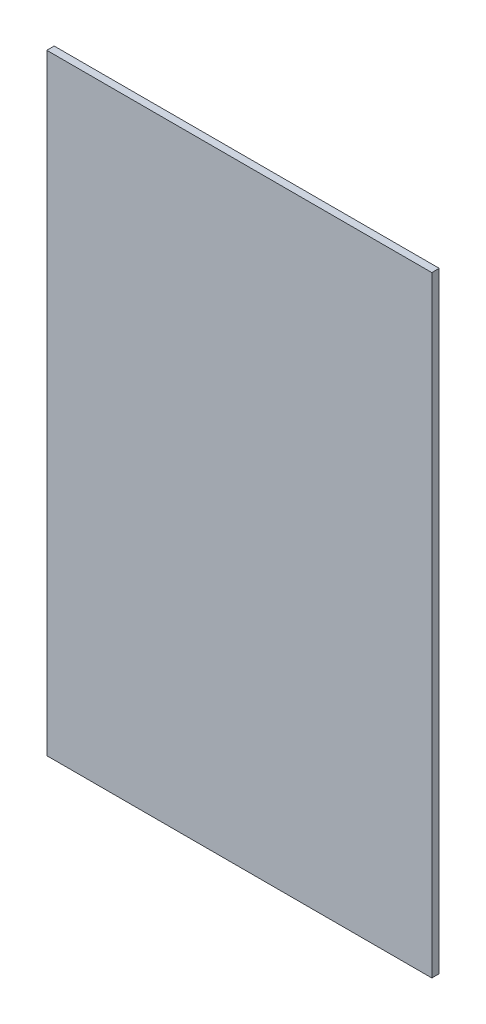
ISO-10303-21;
HEADER;
FILE_DESCRIPTION(('STEP AP214'),'2;1');
FILE_NAME('part.step','',(''),(''),'','','');
FILE_SCHEMA(('AUTOMOTIVE_DESIGN { 1 0 10303 214 1 1 1 1 }'));
ENDSEC;
DATA;
#1=APPLICATION_CONTEXT('core data for automotive mechanical design processes');
#2=APPLICATION_PROTOCOL_DEFINITION('international standard','automotive_design',2000,#1);
#3=PRODUCT_CONTEXT('',#1,'mechanical');
#4=PRODUCT('Part','Part','',(#3));
#5=PRODUCT_RELATED_PRODUCT_CATEGORY('part','',(#4));
#6=PRODUCT_DEFINITION_FORMATION('','',#4);
#7=PRODUCT_DEFINITION_CONTEXT('part definition',#1,'design');
#8=PRODUCT_DEFINITION('design','',#6,#7);
#9=PRODUCT_DEFINITION_SHAPE('','',#8);
#10=(LENGTH_UNIT() NAMED_UNIT(*) SI_UNIT(.MILLI.,.METRE.));
#11=(NAMED_UNIT(*) PLANE_ANGLE_UNIT() SI_UNIT($,.RADIAN.));
#12=(NAMED_UNIT(*) SI_UNIT($,.STERADIAN.) SOLID_ANGLE_UNIT());
#13=UNCERTAINTY_MEASURE_WITH_UNIT(LENGTH_MEASURE(1.E-05),#10,'distance_accuracy_value','');
#14=(GEOMETRIC_REPRESENTATION_CONTEXT(3) GLOBAL_UNCERTAINTY_ASSIGNED_CONTEXT((#13)) GLOBAL_UNIT_ASSIGNED_CONTEXT((#10,
#11,#12)) REPRESENTATION_CONTEXT('',''));
#15=CARTESIAN_POINT('',(0.,0.,0.));
#16=DIRECTION('',(0.,0.,1.));
#17=DIRECTION('',(1.,0.,0.));
#18=AXIS2_PLACEMENT_3D('',#15,#16,#17);
#19=CARTESIAN_POINT('',(-660.4,835.025,82.55));
#20=DIRECTION('',(1.,0.,0.));
#21=DIRECTION('',(0.,1.,0.));
#22=AXIS2_PLACEMENT_3D('',#19,#20,#21);
#23=PLANE('',#22);
#24=DIRECTION('',(0.,1.,0.));
#25=VECTOR('',#24,1.);
#26=CARTESIAN_POINT('',(-660.4,660.4,88.9));
#27=LINE('',#26,#25);
#28=CARTESIAN_POINT('',(-660.4,323.85,88.9));
#29=VERTEX_POINT('',#28);
#30=CARTESIAN_POINT('',(-660.4,1371.6,88.9));
#31=VERTEX_POINT('',#30);
#32=EDGE_CURVE('E82',#29,#31,#27,.T.);
#33=ORIENTED_EDGE('',*,*,#32,.F.);
#34=DIRECTION('',(0.,0.,-1.));
#35=VECTOR('',#34,1.);
#36=CARTESIAN_POINT('',(-660.4,323.85,88.902));
#37=LINE('',#36,#35);
#38=CARTESIAN_POINT('',(-660.4,323.85,76.2));
#39=VERTEX_POINT('',#38);
#40=EDGE_CURVE('E86',#29,#39,#37,.T.);
#41=ORIENTED_EDGE('',*,*,#40,.T.);
#42=DIRECTION('',(0.,1.,0.));
#43=VECTOR('',#42,1.);
#44=CARTESIAN_POINT('',(-660.4,847.725,76.2));
#45=LINE('',#44,#43);
#46=CARTESIAN_POINT('',(-660.4,1371.6,76.2));
#47=VERTEX_POINT('',#46);
#48=EDGE_CURVE('E91',#39,#47,#45,.T.);
#49=ORIENTED_EDGE('',*,*,#48,.T.);
#50=DIRECTION('',(0.,0.,1.));
#51=VECTOR('',#50,1.);
#52=CARTESIAN_POINT('',(-660.4,1371.6,88.902));
#53=LINE('',#52,#51);
#54=EDGE_CURVE('E75',#47,#31,#53,.T.);
#55=ORIENTED_EDGE('',*,*,#54,.T.);
#56=EDGE_LOOP('',(#33,#41,#49,#55));
#57=FACE_BOUND('',#56,.T.);
#58=ADVANCED_FACE('F16',(#57),#23,.T.);
#59=CARTESIAN_POINT('',(-1320.8,847.725,88.902));
#60=DIRECTION('',(1.,0.,0.));
#61=DIRECTION('',(0.,1.,0.));
#62=AXIS2_PLACEMENT_3D('',#59,#60,#61);
#63=PLANE('',#62);
#64=DIRECTION('',(0.,-1.,0.));
#65=VECTOR('',#64,1.);
#66=CARTESIAN_POINT('',(-1320.8,847.725,88.9));
#67=LINE('',#66,#65);
#68=CARTESIAN_POINT('',(-1320.8,1371.6,88.9));
#69=VERTEX_POINT('',#68);
#70=CARTESIAN_POINT('',(-1320.8,323.85,88.9));
#71=VERTEX_POINT('',#70);
#72=EDGE_CURVE('E11',#69,#71,#67,.T.);
#73=ORIENTED_EDGE('',*,*,#72,.F.);
#74=DIRECTION('',(0.,0.,-1.));
#75=VECTOR('',#74,1.);
#76=CARTESIAN_POINT('',(-1320.8,1371.6,88.902));
#77=LINE('',#76,#75);
#78=CARTESIAN_POINT('',(-1320.8,1371.6,76.2));
#79=VERTEX_POINT('',#78);
#80=EDGE_CURVE('E104',#69,#79,#77,.T.);
#81=ORIENTED_EDGE('',*,*,#80,.T.);
#82=DIRECTION('',(0.,-1.,0.));
#83=VECTOR('',#82,1.);
#84=CARTESIAN_POINT('',(-1320.8,847.725,76.2));
#85=LINE('',#84,#83);
#86=CARTESIAN_POINT('',(-1320.8,323.85,76.2));
#87=VERTEX_POINT('',#86);
#88=EDGE_CURVE('E101',#79,#87,#85,.T.);
#89=ORIENTED_EDGE('',*,*,#88,.T.);
#90=DIRECTION('',(0.,0.,-1.));
#91=VECTOR('',#90,1.);
#92=CARTESIAN_POINT('',(-1320.8,323.85,88.902));
#93=LINE('',#92,#91);
#94=EDGE_CURVE('E55',#71,#87,#93,.T.);
#95=ORIENTED_EDGE('',*,*,#94,.F.);
#96=EDGE_LOOP('',(#73,#81,#89,#95));
#97=FACE_BOUND('',#96,.T.);
#98=ADVANCED_FACE('F119',(#97),#63,.F.);
#99=CARTESIAN_POINT('',(-660.4,323.85,88.902));
#100=DIRECTION('',(0.,1.,0.));
#101=DIRECTION('',(0.,0.,1.));
#102=AXIS2_PLACEMENT_3D('',#99,#100,#101);
#103=PLANE('',#102);
#104=ORIENTED_EDGE('',*,*,#40,.F.);
#105=DIRECTION('',(1.,0.,0.));
#106=VECTOR('',#105,1.);
#107=CARTESIAN_POINT('',(-660.4,323.85,88.9));
#108=LINE('',#107,#106);
#109=EDGE_CURVE('E19',#71,#29,#108,.T.);
#110=ORIENTED_EDGE('',*,*,#109,.F.);
#111=ORIENTED_EDGE('',*,*,#94,.T.);
#112=DIRECTION('',(1.,0.,0.));
#113=VECTOR('',#112,1.);
#114=CARTESIAN_POINT('',(-660.4,323.85,76.2));
#115=LINE('',#114,#113);
#116=EDGE_CURVE('E65',#87,#39,#115,.T.);
#117=ORIENTED_EDGE('',*,*,#116,.T.);
#118=EDGE_LOOP('',(#104,#110,#111,#117));
#119=FACE_BOUND('',#118,.T.);
#120=ADVANCED_FACE('F87',(#119),#103,.F.);
#121=CARTESIAN_POINT('',(-660.4,847.725,76.2));
#122=DIRECTION('',(0.,0.,1.));
#123=DIRECTION('',(1.,0.,0.));
#124=AXIS2_PLACEMENT_3D('',#121,#122,#123);
#125=PLANE('',#124);
#126=ORIENTED_EDGE('',*,*,#48,.F.);
#127=ORIENTED_EDGE('',*,*,#116,.F.);
#128=ORIENTED_EDGE('',*,*,#88,.F.);
#129=DIRECTION('',(-1.,0.,0.));
#130=VECTOR('',#129,1.);
#131=CARTESIAN_POINT('',(-796.925,1371.6,76.2));
#132=LINE('',#131,#130);
#133=EDGE_CURVE('E84',#47,#79,#132,.T.);
#134=ORIENTED_EDGE('',*,*,#133,.F.);
#135=EDGE_LOOP('',(#126,#127,#128,#134));
#136=FACE_BOUND('',#135,.T.);
#137=ADVANCED_FACE('F121',(#136),#125,.F.);
#138=CARTESIAN_POINT('',(-796.925,1371.6,88.902));
#139=DIRECTION('',(0.,-1.,0.));
#140=DIRECTION('',(0.,0.,-1.));
#141=AXIS2_PLACEMENT_3D('',#138,#139,#140);
#142=PLANE('',#141);
#143=ORIENTED_EDGE('',*,*,#54,.F.);
#144=ORIENTED_EDGE('',*,*,#133,.T.);
#145=ORIENTED_EDGE('',*,*,#80,.F.);
#146=DIRECTION('',(-1.,0.,0.));
#147=VECTOR('',#146,1.);
#148=CARTESIAN_POINT('',(-796.925,1371.6,88.9));
#149=LINE('',#148,#147);
#150=EDGE_CURVE('E26',#31,#69,#149,.T.);
#151=ORIENTED_EDGE('',*,*,#150,.F.);
#152=EDGE_LOOP('',(#143,#144,#145,#151));
#153=FACE_BOUND('',#152,.T.);
#154=ADVANCED_FACE('F122',(#153),#142,.F.);
#155=CARTESIAN_POINT('',(2.22044604925032E-13,660.4,88.9));
#156=DIRECTION('',(0.,0.,1.));
#157=DIRECTION('',(1.,0.,0.));
#158=AXIS2_PLACEMENT_3D('',#155,#156,#157);
#159=PLANE('',#158);
#160=ORIENTED_EDGE('',*,*,#109,.T.);
#161=ORIENTED_EDGE('',*,*,#32,.T.);
#162=ORIENTED_EDGE('',*,*,#150,.T.);
#163=ORIENTED_EDGE('',*,*,#72,.T.);
#164=EDGE_LOOP('',(#160,#161,#162,#163));
#165=FACE_BOUND('',#164,.T.);
#166=ADVANCED_FACE('F80',(#165),#159,.T.);
#167=CLOSED_SHELL('',(#58,#98,#120,#137,#154,#166));
#168=MANIFOLD_SOLID_BREP('B1',#167);
#169=ADVANCED_BREP_SHAPE_REPRESENTATION('',(#18,#168),#14);
#170=SHAPE_DEFINITION_REPRESENTATION(#9,#169);
ENDSEC;
END-ISO-10303-21;
